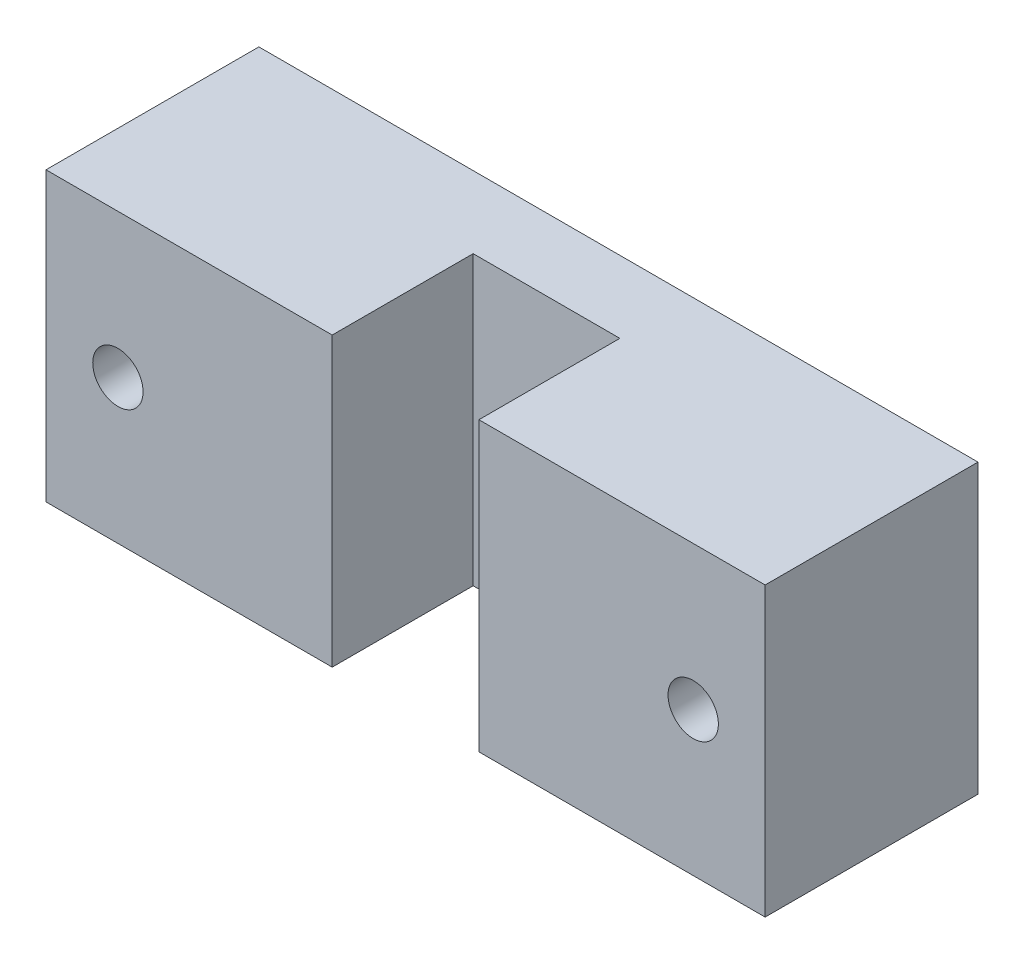
ISO-10303-21;
HEADER;
FILE_DESCRIPTION(('STEP AP214'),'2;1');
FILE_NAME('part.step','',(''),(''),'','','');
FILE_SCHEMA(('AUTOMOTIVE_DESIGN { 1 0 10303 214 1 1 1 1 }'));
ENDSEC;
DATA;
#1=APPLICATION_CONTEXT('core data for automotive mechanical design processes');
#2=APPLICATION_PROTOCOL_DEFINITION('international standard','automotive_design',2000,#1);
#3=PRODUCT_CONTEXT('',#1,'mechanical');
#4=PRODUCT('Part','Part','',(#3));
#5=PRODUCT_RELATED_PRODUCT_CATEGORY('part','',(#4));
#6=PRODUCT_DEFINITION_FORMATION('','',#4);
#7=PRODUCT_DEFINITION_CONTEXT('part definition',#1,'design');
#8=PRODUCT_DEFINITION('design','',#6,#7);
#9=PRODUCT_DEFINITION_SHAPE('','',#8);
#10=(LENGTH_UNIT() NAMED_UNIT(*) SI_UNIT(.MILLI.,.METRE.));
#11=(NAMED_UNIT(*) PLANE_ANGLE_UNIT() SI_UNIT($,.RADIAN.));
#12=(NAMED_UNIT(*) SI_UNIT($,.STERADIAN.) SOLID_ANGLE_UNIT());
#13=UNCERTAINTY_MEASURE_WITH_UNIT(LENGTH_MEASURE(1.E-05),#10,'distance_accuracy_value','');
#14=(GEOMETRIC_REPRESENTATION_CONTEXT(3) GLOBAL_UNCERTAINTY_ASSIGNED_CONTEXT((#13)) GLOBAL_UNIT_ASSIGNED_CONTEXT((#10,
#11,#12)) REPRESENTATION_CONTEXT('',''));
#15=CARTESIAN_POINT('',(0.,0.,0.));
#16=DIRECTION('',(0.,0.,1.));
#17=DIRECTION('',(1.,0.,0.));
#18=AXIS2_PLACEMENT_3D('',#15,#16,#17);
#19=CARTESIAN_POINT('',(0.,0.,5.));
#20=DIRECTION('',(0.,0.,1.));
#21=DIRECTION('',(1.,0.,0.));
#22=AXIS2_PLACEMENT_3D('',#19,#20,#21);
#23=PLANE('',#22);
#24=DIRECTION('',(0.,-1.,0.));
#25=VECTOR('',#24,1.);
#26=CARTESIAN_POINT('',(-5.1,62.1444148495311,5.));
#27=LINE('',#26,#25);
#28=CARTESIAN_POINT('',(-5.1,10.,5.));
#29=VERTEX_POINT('',#28);
#30=CARTESIAN_POINT('',(-5.1,-9.99999999999999,5.));
#31=VERTEX_POINT('',#30);
#32=EDGE_CURVE('E55',#29,#31,#27,.T.);
#33=ORIENTED_EDGE('',*,*,#32,.T.);
#34=DIRECTION('',(1.,0.,0.));
#35=VECTOR('',#34,1.);
#36=CARTESIAN_POINT('',(25.,-9.99999999999999,5.));
#37=LINE('',#36,#35);
#38=CARTESIAN_POINT('',(5.1,-9.99999999999999,5.));
#39=VERTEX_POINT('',#38);
#40=EDGE_CURVE('E50',#31,#39,#37,.T.);
#41=ORIENTED_EDGE('',*,*,#40,.T.);
#42=DIRECTION('',(0.,-1.,0.));
#43=VECTOR('',#42,1.);
#44=CARTESIAN_POINT('',(5.1,62.1444148495311,5.));
#45=LINE('',#44,#43);
#46=CARTESIAN_POINT('',(5.1,10.,5.));
#47=VERTEX_POINT('',#46);
#48=EDGE_CURVE('E143',#47,#39,#45,.T.);
#49=ORIENTED_EDGE('',*,*,#48,.F.);
#50=DIRECTION('',(-1.,0.,0.));
#51=VECTOR('',#50,1.);
#52=CARTESIAN_POINT('',(25.,10.,5.));
#53=LINE('',#52,#51);
#54=EDGE_CURVE('E154',#47,#29,#53,.T.);
#55=ORIENTED_EDGE('',*,*,#54,.T.);
#56=EDGE_LOOP('',(#33,#41,#49,#55));
#57=FACE_BOUND('',#56,.T.);
#58=ADVANCED_FACE('F35',(#57),#23,.T.);
#59=CARTESIAN_POINT('',(0.,0.,0.));
#60=DIRECTION('',(0.,0.,1.));
#61=DIRECTION('',(1.,0.,0.));
#62=AXIS2_PLACEMENT_3D('',#59,#60,#61);
#63=PLANE('',#62);
#64=DIRECTION('',(0.,-1.,0.));
#65=VECTOR('',#64,1.);
#66=CARTESIAN_POINT('',(-25.,-9.99999999999999,0.));
#67=LINE('',#66,#65);
#68=CARTESIAN_POINT('',(-25.,10.,0.));
#69=VERTEX_POINT('',#68);
#70=CARTESIAN_POINT('',(-25.,-9.99999999999999,0.));
#71=VERTEX_POINT('',#70);
#72=EDGE_CURVE('E152',#69,#71,#67,.T.);
#73=ORIENTED_EDGE('',*,*,#72,.F.);
#74=DIRECTION('',(-1.,0.,0.));
#75=VECTOR('',#74,1.);
#76=CARTESIAN_POINT('',(25.,10.,0.));
#77=LINE('',#76,#75);
#78=CARTESIAN_POINT('',(25.,10.,0.));
#79=VERTEX_POINT('',#78);
#80=EDGE_CURVE('E155',#79,#69,#77,.T.);
#81=ORIENTED_EDGE('',*,*,#80,.F.);
#82=DIRECTION('',(0.,1.,0.));
#83=VECTOR('',#82,1.);
#84=CARTESIAN_POINT('',(25.,-9.99999999999999,0.));
#85=LINE('',#84,#83);
#86=CARTESIAN_POINT('',(25.,-9.99999999999999,0.));
#87=VERTEX_POINT('',#86);
#88=EDGE_CURVE('E161',#87,#79,#85,.T.);
#89=ORIENTED_EDGE('',*,*,#88,.F.);
#90=DIRECTION('',(1.,0.,0.));
#91=VECTOR('',#90,1.);
#92=CARTESIAN_POINT('',(25.,-9.99999999999999,0.));
#93=LINE('',#92,#91);
#94=EDGE_CURVE('E103',#71,#87,#93,.T.);
#95=ORIENTED_EDGE('',*,*,#94,.F.);
#96=EDGE_LOOP('',(#73,#81,#89,#95));
#97=FACE_BOUND('',#96,.T.);
#98=CARTESIAN_POINT('',(-20.,0.,0.));
#99=DIRECTION('',(0.,0.,1.));
#100=DIRECTION('',(1.,0.,0.));
#101=AXIS2_PLACEMENT_3D('',#98,#99,#100);
#102=CIRCLE('',#101,1.75);
#103=CARTESIAN_POINT('',(-18.25,0.,0.));
#104=VERTEX_POINT('',#103);
#105=EDGE_CURVE('E149',#104,#104,#102,.T.);
#106=ORIENTED_EDGE('',*,*,#105,.T.);
#107=EDGE_LOOP('',(#106));
#108=FACE_BOUND('',#107,.T.);
#109=CARTESIAN_POINT('',(20.,0.,0.));
#110=DIRECTION('',(0.,0.,1.));
#111=DIRECTION('',(1.,0.,0.));
#112=AXIS2_PLACEMENT_3D('',#109,#110,#111);
#113=CIRCLE('',#112,1.75);
#114=CARTESIAN_POINT('',(21.75,0.,0.));
#115=VERTEX_POINT('',#114);
#116=EDGE_CURVE('E146',#115,#115,#113,.T.);
#117=ORIENTED_EDGE('',*,*,#116,.T.);
#118=EDGE_LOOP('',(#117));
#119=FACE_BOUND('',#118,.T.);
#120=ADVANCED_FACE('F171',(#97,#108,#119),#63,.F.);
#121=CARTESIAN_POINT('',(-25.,-9.99999999999999,5.));
#122=DIRECTION('',(1.,0.,0.));
#123=DIRECTION('',(0.,1.,0.));
#124=AXIS2_PLACEMENT_3D('',#121,#122,#123);
#125=PLANE('',#124);
#126=ORIENTED_EDGE('',*,*,#72,.T.);
#127=DIRECTION('',(0.,0.,-1.));
#128=VECTOR('',#127,1.);
#129=CARTESIAN_POINT('',(-25.,-9.99999999999999,5.));
#130=LINE('',#129,#128);
#131=CARTESIAN_POINT('',(-25.,-9.99999999999999,14.8));
#132=VERTEX_POINT('',#131);
#133=EDGE_CURVE('E11',#132,#71,#130,.T.);
#134=ORIENTED_EDGE('',*,*,#133,.F.);
#135=DIRECTION('',(0.,-1.,0.));
#136=VECTOR('',#135,1.);
#137=CARTESIAN_POINT('',(-25.,62.1444148495311,14.8));
#138=LINE('',#137,#136);
#139=CARTESIAN_POINT('',(-25.,10.,14.8));
#140=VERTEX_POINT('',#139);
#141=EDGE_CURVE('E136',#140,#132,#138,.T.);
#142=ORIENTED_EDGE('',*,*,#141,.F.);
#143=DIRECTION('',(0.,0.,-1.));
#144=VECTOR('',#143,1.);
#145=CARTESIAN_POINT('',(-25.,10.,5.));
#146=LINE('',#145,#144);
#147=EDGE_CURVE('E157',#140,#69,#146,.T.);
#148=ORIENTED_EDGE('',*,*,#147,.T.);
#149=EDGE_LOOP('',(#126,#134,#142,#148));
#150=FACE_BOUND('',#149,.T.);
#151=ADVANCED_FACE('F37',(#150),#125,.F.);
#152=CARTESIAN_POINT('',(25.,-9.99999999999999,5.));
#153=DIRECTION('',(0.,1.,0.));
#154=DIRECTION('',(-1.,0.,0.));
#155=AXIS2_PLACEMENT_3D('',#152,#153,#154);
#156=PLANE('',#155);
#157=ORIENTED_EDGE('',*,*,#94,.T.);
#158=DIRECTION('',(0.,0.,-1.));
#159=VECTOR('',#158,1.);
#160=CARTESIAN_POINT('',(25.,-9.99999999999999,5.));
#161=LINE('',#160,#159);
#162=CARTESIAN_POINT('',(25.,-9.99999999999999,14.8));
#163=VERTEX_POINT('',#162);
#164=EDGE_CURVE('E43',#163,#87,#161,.T.);
#165=ORIENTED_EDGE('',*,*,#164,.F.);
#166=DIRECTION('',(-1.,0.,0.));
#167=VECTOR('',#166,1.);
#168=CARTESIAN_POINT('',(5.1,-9.99999999999999,14.8));
#169=LINE('',#168,#167);
#170=CARTESIAN_POINT('',(5.1,-9.99999999999999,14.8));
#171=VERTEX_POINT('',#170);
#172=EDGE_CURVE('E102',#163,#171,#169,.T.);
#173=ORIENTED_EDGE('',*,*,#172,.T.);
#174=DIRECTION('',(0.,0.,-1.));
#175=VECTOR('',#174,1.);
#176=CARTESIAN_POINT('',(5.1,-9.99999999999999,5.));
#177=LINE('',#176,#175);
#178=EDGE_CURVE('E120',#171,#39,#177,.T.);
#179=ORIENTED_EDGE('',*,*,#178,.T.);
#180=ORIENTED_EDGE('',*,*,#40,.F.);
#181=DIRECTION('',(0.,0.,1.));
#182=VECTOR('',#181,1.);
#183=CARTESIAN_POINT('',(-5.1,-9.99999999999999,14.8));
#184=LINE('',#183,#182);
#185=CARTESIAN_POINT('',(-5.1,-9.99999999999999,14.8));
#186=VERTEX_POINT('',#185);
#187=EDGE_CURVE('E123',#31,#186,#184,.T.);
#188=ORIENTED_EDGE('',*,*,#187,.T.);
#189=DIRECTION('',(-1.,0.,0.));
#190=VECTOR('',#189,1.);
#191=CARTESIAN_POINT('',(-25.,-9.99999999999999,14.8));
#192=LINE('',#191,#190);
#193=EDGE_CURVE('E115',#186,#132,#192,.T.);
#194=ORIENTED_EDGE('',*,*,#193,.T.);
#195=ORIENTED_EDGE('',*,*,#133,.T.);
#196=EDGE_LOOP('',(#157,#165,#173,#179,#180,#188,#194,#195));
#197=FACE_BOUND('',#196,.T.);
#198=ADVANCED_FACE('F99',(#197),#156,.F.);
#199=CARTESIAN_POINT('',(25.,-9.99999999999999,5.));
#200=DIRECTION('',(-1.,0.,0.));
#201=DIRECTION('',(0.,-1.,0.));
#202=AXIS2_PLACEMENT_3D('',#199,#200,#201);
#203=PLANE('',#202);
#204=ORIENTED_EDGE('',*,*,#88,.T.);
#205=DIRECTION('',(0.,0.,-1.));
#206=VECTOR('',#205,1.);
#207=CARTESIAN_POINT('',(25.,10.,5.));
#208=LINE('',#207,#206);
#209=CARTESIAN_POINT('',(25.,10.,14.8));
#210=VERTEX_POINT('',#209);
#211=EDGE_CURVE('E106',#210,#79,#208,.T.);
#212=ORIENTED_EDGE('',*,*,#211,.F.);
#213=DIRECTION('',(0.,-1.,0.));
#214=VECTOR('',#213,1.);
#215=CARTESIAN_POINT('',(25.,62.1444148495311,14.8));
#216=LINE('',#215,#214);
#217=EDGE_CURVE('E108',#210,#163,#216,.T.);
#218=ORIENTED_EDGE('',*,*,#217,.T.);
#219=ORIENTED_EDGE('',*,*,#164,.T.);
#220=EDGE_LOOP('',(#204,#212,#218,#219));
#221=FACE_BOUND('',#220,.T.);
#222=ADVANCED_FACE('F109',(#221),#203,.F.);
#223=CARTESIAN_POINT('',(25.,10.,5.));
#224=DIRECTION('',(0.,-1.,0.));
#225=DIRECTION('',(1.,0.,0.));
#226=AXIS2_PLACEMENT_3D('',#223,#224,#225);
#227=PLANE('',#226);
#228=ORIENTED_EDGE('',*,*,#80,.T.);
#229=ORIENTED_EDGE('',*,*,#147,.F.);
#230=DIRECTION('',(1.,0.,0.));
#231=VECTOR('',#230,1.);
#232=CARTESIAN_POINT('',(-25.,10.,14.8));
#233=LINE('',#232,#231);
#234=CARTESIAN_POINT('',(-5.1,10.,14.8));
#235=VERTEX_POINT('',#234);
#236=EDGE_CURVE('E129',#140,#235,#233,.T.);
#237=ORIENTED_EDGE('',*,*,#236,.T.);
#238=DIRECTION('',(0.,0.,-1.));
#239=VECTOR('',#238,1.);
#240=CARTESIAN_POINT('',(-5.1,10.,14.8));
#241=LINE('',#240,#239);
#242=EDGE_CURVE('E182',#235,#29,#241,.T.);
#243=ORIENTED_EDGE('',*,*,#242,.T.);
#244=ORIENTED_EDGE('',*,*,#54,.F.);
#245=DIRECTION('',(0.,0.,1.));
#246=VECTOR('',#245,1.);
#247=CARTESIAN_POINT('',(5.1,10.,5.));
#248=LINE('',#247,#246);
#249=CARTESIAN_POINT('',(5.1,10.,14.8));
#250=VERTEX_POINT('',#249);
#251=EDGE_CURVE('E183',#47,#250,#248,.T.);
#252=ORIENTED_EDGE('',*,*,#251,.T.);
#253=DIRECTION('',(1.,0.,0.));
#254=VECTOR('',#253,1.);
#255=CARTESIAN_POINT('',(5.1,10.,14.8));
#256=LINE('',#255,#254);
#257=EDGE_CURVE('E139',#250,#210,#256,.T.);
#258=ORIENTED_EDGE('',*,*,#257,.T.);
#259=ORIENTED_EDGE('',*,*,#211,.T.);
#260=EDGE_LOOP('',(#228,#229,#237,#243,#244,#252,#258,#259));
#261=FACE_BOUND('',#260,.T.);
#262=ADVANCED_FACE('F168',(#261),#227,.F.);
#263=CARTESIAN_POINT('',(-20.,0.,5.));
#264=DIRECTION('',(0.,0.,-1.));
#265=DIRECTION('',(-1.,0.,0.));
#266=AXIS2_PLACEMENT_3D('',#263,#264,#265);
#267=CYLINDRICAL_SURFACE('',#266,1.75);
#268=ORIENTED_EDGE('',*,*,#105,.F.);
#269=EDGE_LOOP('',(#268));
#270=FACE_BOUND('',#269,.T.);
#271=CARTESIAN_POINT('',(-20.,0.,14.8));
#272=DIRECTION('',(0.,0.,-1.));
#273=DIRECTION('',(-1.,0.,0.));
#274=AXIS2_PLACEMENT_3D('',#271,#272,#273);
#275=CIRCLE('',#274,1.75);
#276=CARTESIAN_POINT('',(-21.75,0.,14.8));
#277=VERTEX_POINT('',#276);
#278=EDGE_CURVE('E121',#277,#277,#275,.T.);
#279=ORIENTED_EDGE('',*,*,#278,.F.);
#280=EDGE_LOOP('',(#279));
#281=FACE_BOUND('',#280,.T.);
#282=ADVANCED_FACE('F194',(#270,#281),#267,.F.);
#283=CARTESIAN_POINT('',(20.,0.,5.));
#284=DIRECTION('',(0.,0.,-1.));
#285=DIRECTION('',(-1.,0.,0.));
#286=AXIS2_PLACEMENT_3D('',#283,#284,#285);
#287=CYLINDRICAL_SURFACE('',#286,1.75);
#288=ORIENTED_EDGE('',*,*,#116,.F.);
#289=EDGE_LOOP('',(#288));
#290=FACE_BOUND('',#289,.T.);
#291=CARTESIAN_POINT('',(20.,0.,14.8));
#292=DIRECTION('',(0.,0.,-1.));
#293=DIRECTION('',(-1.,0.,0.));
#294=AXIS2_PLACEMENT_3D('',#291,#292,#293);
#295=CIRCLE('',#294,1.75);
#296=CARTESIAN_POINT('',(18.25,0.,14.8));
#297=VERTEX_POINT('',#296);
#298=EDGE_CURVE('E126',#297,#297,#295,.T.);
#299=ORIENTED_EDGE('',*,*,#298,.F.);
#300=EDGE_LOOP('',(#299));
#301=FACE_BOUND('',#300,.T.);
#302=ADVANCED_FACE('F192',(#290,#301),#287,.F.);
#303=CARTESIAN_POINT('',(5.1,62.1444148495311,14.8));
#304=DIRECTION('',(0.,0.,1.));
#305=DIRECTION('',(1.,0.,0.));
#306=AXIS2_PLACEMENT_3D('',#303,#304,#305);
#307=PLANE('',#306);
#308=ORIENTED_EDGE('',*,*,#298,.T.);
#309=EDGE_LOOP('',(#308));
#310=FACE_BOUND('',#309,.T.);
#311=ORIENTED_EDGE('',*,*,#257,.F.);
#312=DIRECTION('',(0.,-1.,0.));
#313=VECTOR('',#312,1.);
#314=CARTESIAN_POINT('',(5.1,62.1444148495311,14.8));
#315=LINE('',#314,#313);
#316=EDGE_CURVE('E114',#250,#171,#315,.T.);
#317=ORIENTED_EDGE('',*,*,#316,.T.);
#318=ORIENTED_EDGE('',*,*,#172,.F.);
#319=ORIENTED_EDGE('',*,*,#217,.F.);
#320=EDGE_LOOP('',(#311,#317,#318,#319));
#321=FACE_BOUND('',#320,.T.);
#322=ADVANCED_FACE('F117',(#310,#321),#307,.T.);
#323=CARTESIAN_POINT('',(5.1,62.1444148495311,5.));
#324=DIRECTION('',(-1.,0.,0.));
#325=DIRECTION('',(0.,0.,1.));
#326=AXIS2_PLACEMENT_3D('',#323,#324,#325);
#327=PLANE('',#326);
#328=ORIENTED_EDGE('',*,*,#251,.F.);
#329=ORIENTED_EDGE('',*,*,#48,.T.);
#330=ORIENTED_EDGE('',*,*,#178,.F.);
#331=ORIENTED_EDGE('',*,*,#316,.F.);
#332=EDGE_LOOP('',(#328,#329,#330,#331));
#333=FACE_BOUND('',#332,.T.);
#334=ADVANCED_FACE('F201',(#333),#327,.T.);
#335=CARTESIAN_POINT('',(-25.,62.1444148495311,14.8));
#336=DIRECTION('',(0.,0.,1.));
#337=DIRECTION('',(1.,0.,0.));
#338=AXIS2_PLACEMENT_3D('',#335,#336,#337);
#339=PLANE('',#338);
#340=ORIENTED_EDGE('',*,*,#278,.T.);
#341=EDGE_LOOP('',(#340));
#342=FACE_BOUND('',#341,.T.);
#343=ORIENTED_EDGE('',*,*,#236,.F.);
#344=ORIENTED_EDGE('',*,*,#141,.T.);
#345=ORIENTED_EDGE('',*,*,#193,.F.);
#346=DIRECTION('',(0.,-1.,0.));
#347=VECTOR('',#346,1.);
#348=CARTESIAN_POINT('',(-5.10000000000001,62.1444148495311,14.8));
#349=LINE('',#348,#347);
#350=EDGE_CURVE('E140',#235,#186,#349,.T.);
#351=ORIENTED_EDGE('',*,*,#350,.F.);
#352=EDGE_LOOP('',(#343,#344,#345,#351));
#353=FACE_BOUND('',#352,.T.);
#354=ADVANCED_FACE('F180',(#342,#353),#339,.T.);
#355=CARTESIAN_POINT('',(-5.10000000000001,62.1444148495311,14.8));
#356=DIRECTION('',(1.,0.,0.));
#357=DIRECTION('',(0.,0.,-1.));
#358=AXIS2_PLACEMENT_3D('',#355,#356,#357);
#359=PLANE('',#358);
#360=ORIENTED_EDGE('',*,*,#242,.F.);
#361=ORIENTED_EDGE('',*,*,#350,.T.);
#362=ORIENTED_EDGE('',*,*,#187,.F.);
#363=ORIENTED_EDGE('',*,*,#32,.F.);
#364=EDGE_LOOP('',(#360,#361,#362,#363));
#365=FACE_BOUND('',#364,.T.);
#366=ADVANCED_FACE('F288',(#365),#359,.T.);
#367=CLOSED_SHELL('',(#58,#120,#151,#198,#222,#262,#282,#302,#322,#334,#354,#366));
#368=MANIFOLD_SOLID_BREP('B2',#367);
#369=ADVANCED_BREP_SHAPE_REPRESENTATION('',(#18,#368),#14);
#370=SHAPE_DEFINITION_REPRESENTATION(#9,#369);
ENDSEC;
END-ISO-10303-21;
